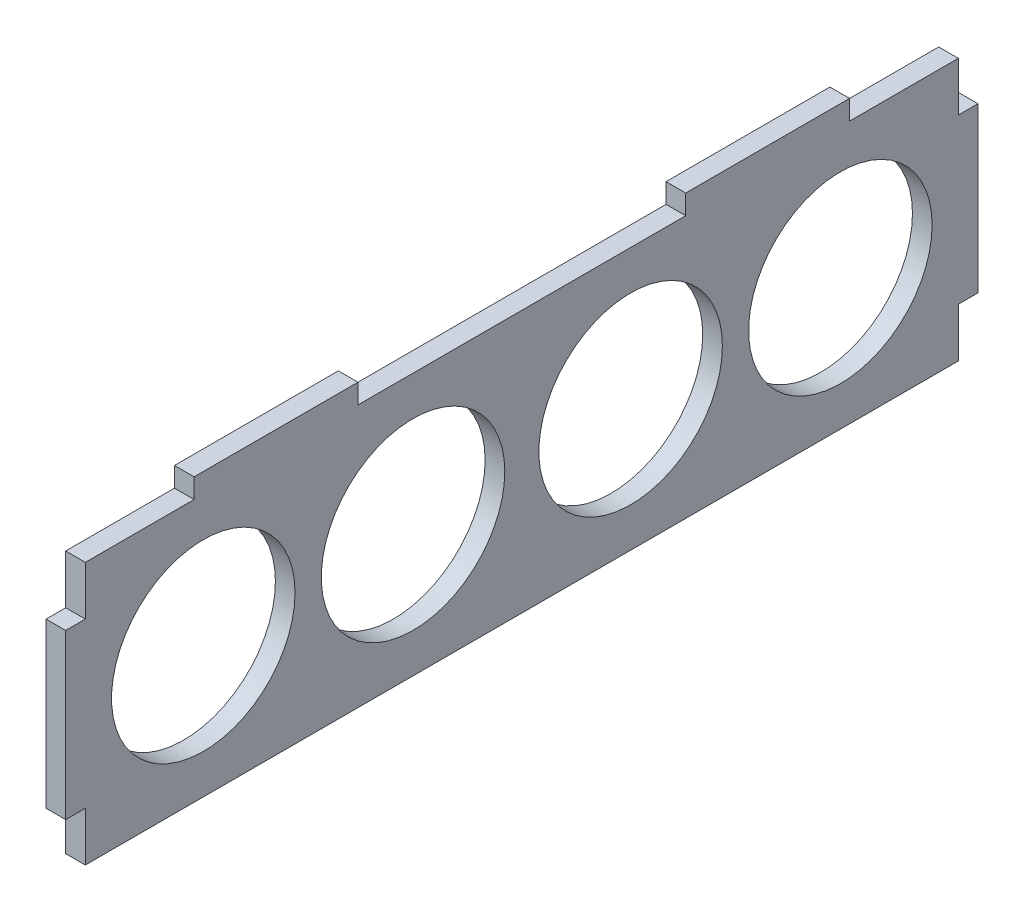
ISO-10303-21;
HEADER;
FILE_DESCRIPTION(('STEP AP214'),'2;1');
FILE_NAME('part.step','',(''),(''),'','','');
FILE_SCHEMA(('AUTOMOTIVE_DESIGN { 1 0 10303 214 1 1 1 1 }'));
ENDSEC;
DATA;
#1=APPLICATION_CONTEXT('core data for automotive mechanical design processes');
#2=APPLICATION_PROTOCOL_DEFINITION('international standard','automotive_design',2000,#1);
#3=PRODUCT_CONTEXT('',#1,'mechanical');
#4=PRODUCT('Part','Part','',(#3));
#5=PRODUCT_RELATED_PRODUCT_CATEGORY('part','',(#4));
#6=PRODUCT_DEFINITION_FORMATION('','',#4);
#7=PRODUCT_DEFINITION_CONTEXT('part definition',#1,'design');
#8=PRODUCT_DEFINITION('design','',#6,#7);
#9=PRODUCT_DEFINITION_SHAPE('','',#8);
#10=(LENGTH_UNIT() NAMED_UNIT(*) SI_UNIT(.MILLI.,.METRE.));
#11=(NAMED_UNIT(*) PLANE_ANGLE_UNIT() SI_UNIT($,.RADIAN.));
#12=(NAMED_UNIT(*) SI_UNIT($,.STERADIAN.) SOLID_ANGLE_UNIT());
#13=UNCERTAINTY_MEASURE_WITH_UNIT(LENGTH_MEASURE(1.E-05),#10,'distance_accuracy_value','');
#14=(GEOMETRIC_REPRESENTATION_CONTEXT(3) GLOBAL_UNCERTAINTY_ASSIGNED_CONTEXT((#13)) GLOBAL_UNIT_ASSIGNED_CONTEXT((#10,
#11,#12)) REPRESENTATION_CONTEXT('',''));
#15=CARTESIAN_POINT('',(0.,0.,0.));
#16=DIRECTION('',(0.,0.,1.));
#17=DIRECTION('',(1.,0.,0.));
#18=AXIS2_PLACEMENT_3D('',#15,#16,#17);
#19=CARTESIAN_POINT('',(3.,-20.,0.));
#20=DIRECTION('',(0.,1.,0.));
#21=DIRECTION('',(0.,0.,1.));
#22=AXIS2_PLACEMENT_3D('',#19,#20,#21);
#23=PLANE('',#22);
#24=DIRECTION('',(0.,0.,-1.));
#25=VECTOR('',#24,1.);
#26=CARTESIAN_POINT('',(0.,-20.,0.));
#27=LINE('',#26,#25);
#28=CARTESIAN_POINT('',(0.,-20.,66.6));
#29=VERTEX_POINT('',#28);
#30=CARTESIAN_POINT('',(0.,-20.,-66.6));
#31=VERTEX_POINT('',#30);
#32=EDGE_CURVE('E223',#29,#31,#27,.T.);
#33=ORIENTED_EDGE('',*,*,#32,.T.);
#34=DIRECTION('',(-1.,0.,0.));
#35=VECTOR('',#34,1.);
#36=CARTESIAN_POINT('',(3.,-20.,-66.6));
#37=LINE('',#36,#35);
#38=CARTESIAN_POINT('',(3.,-20.,-66.6));
#39=VERTEX_POINT('',#38);
#40=EDGE_CURVE('E11',#39,#31,#37,.T.);
#41=ORIENTED_EDGE('',*,*,#40,.F.);
#42=DIRECTION('',(0.,0.,-1.));
#43=VECTOR('',#42,1.);
#44=CARTESIAN_POINT('',(3.,-20.,0.));
#45=LINE('',#44,#43);
#46=CARTESIAN_POINT('',(3.,-20.,66.6));
#47=VERTEX_POINT('',#46);
#48=EDGE_CURVE('E675',#47,#39,#45,.T.);
#49=ORIENTED_EDGE('',*,*,#48,.F.);
#50=DIRECTION('',(-1.,0.,0.));
#51=VECTOR('',#50,1.);
#52=CARTESIAN_POINT('',(3.,-20.,66.6));
#53=LINE('',#52,#51);
#54=EDGE_CURVE('E56',#47,#29,#53,.T.);
#55=ORIENTED_EDGE('',*,*,#54,.T.);
#56=EDGE_LOOP('',(#33,#41,#49,#55));
#57=FACE_BOUND('',#56,.T.);
#58=ADVANCED_FACE('F39',(#57),#23,.F.);
#59=CARTESIAN_POINT('',(3.,0.,-66.6));
#60=DIRECTION('',(0.,0.,1.));
#61=DIRECTION('',(1.,0.,0.));
#62=AXIS2_PLACEMENT_3D('',#59,#60,#61);
#63=PLANE('',#62);
#64=DIRECTION('',(0.,1.,0.));
#65=VECTOR('',#64,1.);
#66=CARTESIAN_POINT('',(0.,0.,-66.6));
#67=LINE('',#66,#65);
#68=CARTESIAN_POINT('',(0.,-12.5,-66.6));
#69=VERTEX_POINT('',#68);
#70=EDGE_CURVE('E225',#31,#69,#67,.T.);
#71=ORIENTED_EDGE('',*,*,#70,.T.);
#72=DIRECTION('',(-1.,0.,0.));
#73=VECTOR('',#72,1.);
#74=CARTESIAN_POINT('',(3.,-12.5,-66.6));
#75=LINE('',#74,#73);
#76=CARTESIAN_POINT('',(3.,-12.5,-66.6));
#77=VERTEX_POINT('',#76);
#78=EDGE_CURVE('E48',#77,#69,#75,.T.);
#79=ORIENTED_EDGE('',*,*,#78,.F.);
#80=DIRECTION('',(0.,1.,0.));
#81=VECTOR('',#80,1.);
#82=CARTESIAN_POINT('',(3.,0.,-66.6));
#83=LINE('',#82,#81);
#84=EDGE_CURVE('E130',#39,#77,#83,.T.);
#85=ORIENTED_EDGE('',*,*,#84,.F.);
#86=ORIENTED_EDGE('',*,*,#40,.T.);
#87=EDGE_LOOP('',(#71,#79,#85,#86));
#88=FACE_BOUND('',#87,.T.);
#89=ADVANCED_FACE('F391',(#88),#63,.F.);
#90=CARTESIAN_POINT('',(3.,-12.5,0.));
#91=DIRECTION('',(0.,1.,0.));
#92=DIRECTION('',(0.,0.,1.));
#93=AXIS2_PLACEMENT_3D('',#90,#91,#92);
#94=PLANE('',#93);
#95=DIRECTION('',(0.,0.,-1.));
#96=VECTOR('',#95,1.);
#97=CARTESIAN_POINT('',(0.,-12.5,0.));
#98=LINE('',#97,#96);
#99=CARTESIAN_POINT('',(0.,-12.5,-69.6));
#100=VERTEX_POINT('',#99);
#101=EDGE_CURVE('E227',#69,#100,#98,.T.);
#102=ORIENTED_EDGE('',*,*,#101,.T.);
#103=DIRECTION('',(-1.,0.,0.));
#104=VECTOR('',#103,1.);
#105=CARTESIAN_POINT('',(3.,-12.5,-69.6));
#106=LINE('',#105,#104);
#107=CARTESIAN_POINT('',(3.,-12.5,-69.6));
#108=VERTEX_POINT('',#107);
#109=EDGE_CURVE('E298',#108,#100,#106,.T.);
#110=ORIENTED_EDGE('',*,*,#109,.F.);
#111=DIRECTION('',(0.,0.,-1.));
#112=VECTOR('',#111,1.);
#113=CARTESIAN_POINT('',(3.,-12.5,0.));
#114=LINE('',#113,#112);
#115=EDGE_CURVE('E305',#77,#108,#114,.T.);
#116=ORIENTED_EDGE('',*,*,#115,.F.);
#117=ORIENTED_EDGE('',*,*,#78,.T.);
#118=EDGE_LOOP('',(#102,#110,#116,#117));
#119=FACE_BOUND('',#118,.T.);
#120=ADVANCED_FACE('F303',(#119),#94,.F.);
#121=CARTESIAN_POINT('',(3.,0.,-69.6));
#122=DIRECTION('',(0.,0.,-1.));
#123=DIRECTION('',(-1.,0.,0.));
#124=AXIS2_PLACEMENT_3D('',#121,#122,#123);
#125=PLANE('',#124);
#126=DIRECTION('',(0.,-1.,0.));
#127=VECTOR('',#126,1.);
#128=CARTESIAN_POINT('',(0.,0.,-69.6));
#129=LINE('',#128,#127);
#130=CARTESIAN_POINT('',(0.,12.5,-69.6));
#131=VERTEX_POINT('',#130);
#132=EDGE_CURVE('E231',#131,#100,#129,.T.);
#133=ORIENTED_EDGE('',*,*,#132,.F.);
#134=DIRECTION('',(-1.,0.,0.));
#135=VECTOR('',#134,1.);
#136=CARTESIAN_POINT('',(3.,12.5,-69.6));
#137=LINE('',#136,#135);
#138=CARTESIAN_POINT('',(3.,12.5,-69.6));
#139=VERTEX_POINT('',#138);
#140=EDGE_CURVE('E296',#139,#131,#137,.T.);
#141=ORIENTED_EDGE('',*,*,#140,.F.);
#142=DIRECTION('',(0.,-1.,0.));
#143=VECTOR('',#142,1.);
#144=CARTESIAN_POINT('',(3.,0.,-69.6));
#145=LINE('',#144,#143);
#146=EDGE_CURVE('E315',#139,#108,#145,.T.);
#147=ORIENTED_EDGE('',*,*,#146,.T.);
#148=ORIENTED_EDGE('',*,*,#109,.T.);
#149=EDGE_LOOP('',(#133,#141,#147,#148));
#150=FACE_BOUND('',#149,.T.);
#151=ADVANCED_FACE('F312',(#150),#125,.T.);
#152=CARTESIAN_POINT('',(3.,12.5,0.));
#153=DIRECTION('',(0.,1.,0.));
#154=DIRECTION('',(0.,0.,1.));
#155=AXIS2_PLACEMENT_3D('',#152,#153,#154);
#156=PLANE('',#155);
#157=DIRECTION('',(0.,0.,-1.));
#158=VECTOR('',#157,1.);
#159=CARTESIAN_POINT('',(0.,12.5,0.));
#160=LINE('',#159,#158);
#161=CARTESIAN_POINT('',(0.,12.5,-66.6));
#162=VERTEX_POINT('',#161);
#163=EDGE_CURVE('E234',#162,#131,#160,.T.);
#164=ORIENTED_EDGE('',*,*,#163,.F.);
#165=DIRECTION('',(-1.,0.,0.));
#166=VECTOR('',#165,1.);
#167=CARTESIAN_POINT('',(3.,12.5,-66.6));
#168=LINE('',#167,#166);
#169=CARTESIAN_POINT('',(3.,12.5,-66.6));
#170=VERTEX_POINT('',#169);
#171=EDGE_CURVE('E294',#170,#162,#168,.T.);
#172=ORIENTED_EDGE('',*,*,#171,.F.);
#173=DIRECTION('',(0.,0.,-1.));
#174=VECTOR('',#173,1.);
#175=CARTESIAN_POINT('',(3.,12.5,0.));
#176=LINE('',#175,#174);
#177=EDGE_CURVE('E318',#170,#139,#176,.T.);
#178=ORIENTED_EDGE('',*,*,#177,.T.);
#179=ORIENTED_EDGE('',*,*,#140,.T.);
#180=EDGE_LOOP('',(#164,#172,#178,#179));
#181=FACE_BOUND('',#180,.T.);
#182=ADVANCED_FACE('F622',(#181),#156,.T.);
#183=CARTESIAN_POINT('',(0.,20.,-66.6));
#184=VERTEX_POINT('',#183);
#185=EDGE_CURVE('E228',#162,#184,#67,.T.);
#186=ORIENTED_EDGE('',*,*,#185,.T.);
#187=DIRECTION('',(-1.,0.,0.));
#188=VECTOR('',#187,1.);
#189=CARTESIAN_POINT('',(3.,20.,-66.6));
#190=LINE('',#189,#188);
#191=CARTESIAN_POINT('',(3.,20.,-66.6));
#192=VERTEX_POINT('',#191);
#193=EDGE_CURVE('E292',#192,#184,#190,.T.);
#194=ORIENTED_EDGE('',*,*,#193,.F.);
#195=EDGE_CURVE('E320',#170,#192,#83,.T.);
#196=ORIENTED_EDGE('',*,*,#195,.F.);
#197=ORIENTED_EDGE('',*,*,#171,.T.);
#198=EDGE_LOOP('',(#186,#194,#196,#197));
#199=FACE_BOUND('',#198,.T.);
#200=ADVANCED_FACE('F397',(#199),#63,.F.);
#201=CARTESIAN_POINT('',(3.,20.,0.));
#202=DIRECTION('',(0.,1.,0.));
#203=DIRECTION('',(0.,0.,1.));
#204=AXIS2_PLACEMENT_3D('',#201,#202,#203);
#205=PLANE('',#204);
#206=DIRECTION('',(0.,0.,-1.));
#207=VECTOR('',#206,1.);
#208=CARTESIAN_POINT('',(0.,20.,0.));
#209=LINE('',#208,#207);
#210=CARTESIAN_POINT('',(0.,20.,-50.));
#211=VERTEX_POINT('',#210);
#212=EDGE_CURVE('E237',#211,#184,#209,.T.);
#213=ORIENTED_EDGE('',*,*,#212,.F.);
#214=DIRECTION('',(-1.,0.,0.));
#215=VECTOR('',#214,1.);
#216=CARTESIAN_POINT('',(3.,20.,-50.));
#217=LINE('',#216,#215);
#218=CARTESIAN_POINT('',(3.,20.,-50.));
#219=VERTEX_POINT('',#218);
#220=EDGE_CURVE('E290',#219,#211,#217,.T.);
#221=ORIENTED_EDGE('',*,*,#220,.F.);
#222=DIRECTION('',(0.,0.,-1.));
#223=VECTOR('',#222,1.);
#224=CARTESIAN_POINT('',(3.,20.,0.));
#225=LINE('',#224,#223);
#226=EDGE_CURVE('E325',#219,#192,#225,.T.);
#227=ORIENTED_EDGE('',*,*,#226,.T.);
#228=ORIENTED_EDGE('',*,*,#193,.T.);
#229=EDGE_LOOP('',(#213,#221,#227,#228));
#230=FACE_BOUND('',#229,.T.);
#231=ADVANCED_FACE('F388',(#230),#205,.T.);
#232=CARTESIAN_POINT('',(3.,0.,-50.));
#233=DIRECTION('',(0.,0.,1.));
#234=DIRECTION('',(1.,0.,0.));
#235=AXIS2_PLACEMENT_3D('',#232,#233,#234);
#236=PLANE('',#235);
#237=DIRECTION('',(0.,1.,0.));
#238=VECTOR('',#237,1.);
#239=CARTESIAN_POINT('',(0.,0.,-50.));
#240=LINE('',#239,#238);
#241=CARTESIAN_POINT('',(0.,23.,-50.));
#242=VERTEX_POINT('',#241);
#243=EDGE_CURVE('E240',#211,#242,#240,.T.);
#244=ORIENTED_EDGE('',*,*,#243,.T.);
#245=DIRECTION('',(-1.,0.,0.));
#246=VECTOR('',#245,1.);
#247=CARTESIAN_POINT('',(3.,23.,-50.));
#248=LINE('',#247,#246);
#249=CARTESIAN_POINT('',(3.,23.,-50.));
#250=VERTEX_POINT('',#249);
#251=EDGE_CURVE('E288',#250,#242,#248,.T.);
#252=ORIENTED_EDGE('',*,*,#251,.F.);
#253=DIRECTION('',(0.,1.,0.));
#254=VECTOR('',#253,1.);
#255=CARTESIAN_POINT('',(3.,0.,-50.));
#256=LINE('',#255,#254);
#257=EDGE_CURVE('E328',#219,#250,#256,.T.);
#258=ORIENTED_EDGE('',*,*,#257,.F.);
#259=ORIENTED_EDGE('',*,*,#220,.T.);
#260=EDGE_LOOP('',(#244,#252,#258,#259));
#261=FACE_BOUND('',#260,.T.);
#262=ADVANCED_FACE('F594',(#261),#236,.F.);
#263=CARTESIAN_POINT('',(3.,23.,0.));
#264=DIRECTION('',(0.,1.,0.));
#265=DIRECTION('',(0.,0.,1.));
#266=AXIS2_PLACEMENT_3D('',#263,#264,#265);
#267=PLANE('',#266);
#268=DIRECTION('',(0.,0.,-1.));
#269=VECTOR('',#268,1.);
#270=CARTESIAN_POINT('',(0.,23.,0.));
#271=LINE('',#270,#269);
#272=CARTESIAN_POINT('',(0.,23.,-25.));
#273=VERTEX_POINT('',#272);
#274=EDGE_CURVE('E245',#273,#242,#271,.T.);
#275=ORIENTED_EDGE('',*,*,#274,.F.);
#276=DIRECTION('',(-1.,0.,0.));
#277=VECTOR('',#276,1.);
#278=CARTESIAN_POINT('',(3.,23.,-25.));
#279=LINE('',#278,#277);
#280=CARTESIAN_POINT('',(3.,23.,-25.));
#281=VERTEX_POINT('',#280);
#282=EDGE_CURVE('E286',#281,#273,#279,.T.);
#283=ORIENTED_EDGE('',*,*,#282,.F.);
#284=DIRECTION('',(0.,0.,-1.));
#285=VECTOR('',#284,1.);
#286=CARTESIAN_POINT('',(3.,23.,0.));
#287=LINE('',#286,#285);
#288=EDGE_CURVE('E332',#281,#250,#287,.T.);
#289=ORIENTED_EDGE('',*,*,#288,.T.);
#290=ORIENTED_EDGE('',*,*,#251,.T.);
#291=EDGE_LOOP('',(#275,#283,#289,#290));
#292=FACE_BOUND('',#291,.T.);
#293=ADVANCED_FACE('F586',(#292),#267,.T.);
#294=CARTESIAN_POINT('',(3.,0.,-25.));
#295=DIRECTION('',(0.,0.,1.));
#296=DIRECTION('',(1.,0.,0.));
#297=AXIS2_PLACEMENT_3D('',#294,#295,#296);
#298=PLANE('',#297);
#299=DIRECTION('',(0.,1.,0.));
#300=VECTOR('',#299,1.);
#301=CARTESIAN_POINT('',(0.,0.,-25.));
#302=LINE('',#301,#300);
#303=CARTESIAN_POINT('',(0.,20.,-25.));
#304=VERTEX_POINT('',#303);
#305=EDGE_CURVE('E248',#304,#273,#302,.T.);
#306=ORIENTED_EDGE('',*,*,#305,.F.);
#307=DIRECTION('',(-1.,0.,0.));
#308=VECTOR('',#307,1.);
#309=CARTESIAN_POINT('',(3.,20.,-25.));
#310=LINE('',#309,#308);
#311=CARTESIAN_POINT('',(3.,20.,-25.));
#312=VERTEX_POINT('',#311);
#313=EDGE_CURVE('E284',#312,#304,#310,.T.);
#314=ORIENTED_EDGE('',*,*,#313,.F.);
#315=DIRECTION('',(0.,1.,0.));
#316=VECTOR('',#315,1.);
#317=CARTESIAN_POINT('',(3.,0.,-25.));
#318=LINE('',#317,#316);
#319=EDGE_CURVE('E335',#312,#281,#318,.T.);
#320=ORIENTED_EDGE('',*,*,#319,.T.);
#321=ORIENTED_EDGE('',*,*,#282,.T.);
#322=EDGE_LOOP('',(#306,#314,#320,#321));
#323=FACE_BOUND('',#322,.T.);
#324=ADVANCED_FACE('F362',(#323),#298,.T.);
#325=CARTESIAN_POINT('',(0.,20.,25.));
#326=VERTEX_POINT('',#325);
#327=EDGE_CURVE('E242',#326,#304,#209,.T.);
#328=ORIENTED_EDGE('',*,*,#327,.F.);
#329=DIRECTION('',(-1.,0.,0.));
#330=VECTOR('',#329,1.);
#331=CARTESIAN_POINT('',(3.,20.,25.));
#332=LINE('',#331,#330);
#333=CARTESIAN_POINT('',(3.,20.,25.));
#334=VERTEX_POINT('',#333);
#335=EDGE_CURVE('E282',#334,#326,#332,.T.);
#336=ORIENTED_EDGE('',*,*,#335,.F.);
#337=EDGE_CURVE('E330',#334,#312,#225,.T.);
#338=ORIENTED_EDGE('',*,*,#337,.T.);
#339=ORIENTED_EDGE('',*,*,#313,.T.);
#340=EDGE_LOOP('',(#328,#336,#338,#339));
#341=FACE_BOUND('',#340,.T.);
#342=ADVANCED_FACE('F354',(#341),#205,.T.);
#343=CARTESIAN_POINT('',(3.,0.,25.));
#344=DIRECTION('',(0.,0.,1.));
#345=DIRECTION('',(1.,0.,0.));
#346=AXIS2_PLACEMENT_3D('',#343,#344,#345);
#347=PLANE('',#346);
#348=DIRECTION('',(0.,1.,0.));
#349=VECTOR('',#348,1.);
#350=CARTESIAN_POINT('',(0.,0.,25.));
#351=LINE('',#350,#349);
#352=CARTESIAN_POINT('',(0.,23.,25.));
#353=VERTEX_POINT('',#352);
#354=EDGE_CURVE('E251',#326,#353,#351,.T.);
#355=ORIENTED_EDGE('',*,*,#354,.T.);
#356=DIRECTION('',(-1.,0.,0.));
#357=VECTOR('',#356,1.);
#358=CARTESIAN_POINT('',(3.,23.,25.));
#359=LINE('',#358,#357);
#360=CARTESIAN_POINT('',(3.,23.,25.));
#361=VERTEX_POINT('',#360);
#362=EDGE_CURVE('E280',#361,#353,#359,.T.);
#363=ORIENTED_EDGE('',*,*,#362,.F.);
#364=DIRECTION('',(0.,1.,0.));
#365=VECTOR('',#364,1.);
#366=CARTESIAN_POINT('',(3.,0.,25.));
#367=LINE('',#366,#365);
#368=EDGE_CURVE('E338',#334,#361,#367,.T.);
#369=ORIENTED_EDGE('',*,*,#368,.F.);
#370=ORIENTED_EDGE('',*,*,#335,.T.);
#371=EDGE_LOOP('',(#355,#363,#369,#370));
#372=FACE_BOUND('',#371,.T.);
#373=ADVANCED_FACE('F379',(#372),#347,.F.);
#374=CARTESIAN_POINT('',(3.,23.,0.));
#375=DIRECTION('',(0.,1.,0.));
#376=DIRECTION('',(0.,0.,1.));
#377=AXIS2_PLACEMENT_3D('',#374,#375,#376);
#378=PLANE('',#377);
#379=DIRECTION('',(0.,0.,-1.));
#380=VECTOR('',#379,1.);
#381=CARTESIAN_POINT('',(0.,23.,0.));
#382=LINE('',#381,#380);
#383=CARTESIAN_POINT('',(0.,23.,50.));
#384=VERTEX_POINT('',#383);
#385=EDGE_CURVE('E254',#384,#353,#382,.T.);
#386=ORIENTED_EDGE('',*,*,#385,.F.);
#387=DIRECTION('',(-1.,0.,0.));
#388=VECTOR('',#387,1.);
#389=CARTESIAN_POINT('',(3.,23.,50.));
#390=LINE('',#389,#388);
#391=CARTESIAN_POINT('',(3.,23.,50.));
#392=VERTEX_POINT('',#391);
#393=EDGE_CURVE('E278',#392,#384,#390,.T.);
#394=ORIENTED_EDGE('',*,*,#393,.F.);
#395=DIRECTION('',(0.,0.,-1.));
#396=VECTOR('',#395,1.);
#397=CARTESIAN_POINT('',(3.,23.,0.));
#398=LINE('',#397,#396);
#399=EDGE_CURVE('E340',#392,#361,#398,.T.);
#400=ORIENTED_EDGE('',*,*,#399,.T.);
#401=ORIENTED_EDGE('',*,*,#362,.T.);
#402=EDGE_LOOP('',(#386,#394,#400,#401));
#403=FACE_BOUND('',#402,.T.);
#404=ADVANCED_FACE('F377',(#403),#378,.T.);
#405=CARTESIAN_POINT('',(3.,0.,50.));
#406=DIRECTION('',(0.,0.,1.));
#407=DIRECTION('',(1.,0.,0.));
#408=AXIS2_PLACEMENT_3D('',#405,#406,#407);
#409=PLANE('',#408);
#410=DIRECTION('',(0.,1.,0.));
#411=VECTOR('',#410,1.);
#412=CARTESIAN_POINT('',(0.,0.,50.));
#413=LINE('',#412,#411);
#414=CARTESIAN_POINT('',(0.,20.,50.));
#415=VERTEX_POINT('',#414);
#416=EDGE_CURVE('E257',#415,#384,#413,.T.);
#417=ORIENTED_EDGE('',*,*,#416,.F.);
#418=DIRECTION('',(-1.,0.,0.));
#419=VECTOR('',#418,1.);
#420=CARTESIAN_POINT('',(3.,20.,50.));
#421=LINE('',#420,#419);
#422=CARTESIAN_POINT('',(3.,20.,50.));
#423=VERTEX_POINT('',#422);
#424=EDGE_CURVE('E276',#423,#415,#421,.T.);
#425=ORIENTED_EDGE('',*,*,#424,.F.);
#426=DIRECTION('',(0.,1.,0.));
#427=VECTOR('',#426,1.);
#428=CARTESIAN_POINT('',(3.,0.,50.));
#429=LINE('',#428,#427);
#430=EDGE_CURVE('E343',#423,#392,#429,.T.);
#431=ORIENTED_EDGE('',*,*,#430,.T.);
#432=ORIENTED_EDGE('',*,*,#393,.T.);
#433=EDGE_LOOP('',(#417,#425,#431,#432));
#434=FACE_BOUND('',#433,.T.);
#435=ADVANCED_FACE('F374',(#434),#409,.T.);
#436=CARTESIAN_POINT('',(0.,20.,66.6));
#437=VERTEX_POINT('',#436);
#438=EDGE_CURVE('E241',#437,#415,#209,.T.);
#439=ORIENTED_EDGE('',*,*,#438,.F.);
#440=DIRECTION('',(-1.,0.,0.));
#441=VECTOR('',#440,1.);
#442=CARTESIAN_POINT('',(3.,20.,66.6));
#443=LINE('',#442,#441);
#444=CARTESIAN_POINT('',(3.,20.,66.6));
#445=VERTEX_POINT('',#444);
#446=EDGE_CURVE('E274',#445,#437,#443,.T.);
#447=ORIENTED_EDGE('',*,*,#446,.F.);
#448=EDGE_CURVE('E329',#445,#423,#225,.T.);
#449=ORIENTED_EDGE('',*,*,#448,.T.);
#450=ORIENTED_EDGE('',*,*,#424,.T.);
#451=EDGE_LOOP('',(#439,#447,#449,#450));
#452=FACE_BOUND('',#451,.T.);
#453=ADVANCED_FACE('F371',(#452),#205,.T.);
#454=CARTESIAN_POINT('',(3.,0.,66.6));
#455=DIRECTION('',(0.,0.,1.));
#456=DIRECTION('',(1.,0.,0.));
#457=AXIS2_PLACEMENT_3D('',#454,#455,#456);
#458=PLANE('',#457);
#459=DIRECTION('',(0.,1.,0.));
#460=VECTOR('',#459,1.);
#461=CARTESIAN_POINT('',(0.,0.,66.6));
#462=LINE('',#461,#460);
#463=CARTESIAN_POINT('',(0.,12.5,66.6));
#464=VERTEX_POINT('',#463);
#465=EDGE_CURVE('E260',#464,#437,#462,.T.);
#466=ORIENTED_EDGE('',*,*,#465,.F.);
#467=DIRECTION('',(-1.,0.,0.));
#468=VECTOR('',#467,1.);
#469=CARTESIAN_POINT('',(3.,12.5,66.6));
#470=LINE('',#469,#468);
#471=CARTESIAN_POINT('',(3.,12.5,66.6));
#472=VERTEX_POINT('',#471);
#473=EDGE_CURVE('E272',#472,#464,#470,.T.);
#474=ORIENTED_EDGE('',*,*,#473,.F.);
#475=DIRECTION('',(0.,1.,0.));
#476=VECTOR('',#475,1.);
#477=CARTESIAN_POINT('',(3.,0.,66.6));
#478=LINE('',#477,#476);
#479=EDGE_CURVE('E208',#472,#445,#478,.T.);
#480=ORIENTED_EDGE('',*,*,#479,.T.);
#481=ORIENTED_EDGE('',*,*,#446,.T.);
#482=EDGE_LOOP('',(#466,#474,#480,#481));
#483=FACE_BOUND('',#482,.T.);
#484=ADVANCED_FACE('F439',(#483),#458,.T.);
#485=CARTESIAN_POINT('',(3.,12.5,0.));
#486=DIRECTION('',(0.,-1.,0.));
#487=DIRECTION('',(0.,0.,-1.));
#488=AXIS2_PLACEMENT_3D('',#485,#486,#487);
#489=PLANE('',#488);
#490=DIRECTION('',(0.,0.,1.));
#491=VECTOR('',#490,1.);
#492=CARTESIAN_POINT('',(0.,12.5,0.));
#493=LINE('',#492,#491);
#494=CARTESIAN_POINT('',(0.,12.5,69.6));
#495=VERTEX_POINT('',#494);
#496=EDGE_CURVE('E263',#464,#495,#493,.T.);
#497=ORIENTED_EDGE('',*,*,#496,.T.);
#498=DIRECTION('',(-1.,0.,0.));
#499=VECTOR('',#498,1.);
#500=CARTESIAN_POINT('',(3.,12.5,69.6));
#501=LINE('',#500,#499);
#502=CARTESIAN_POINT('',(3.,12.5,69.6));
#503=VERTEX_POINT('',#502);
#504=EDGE_CURVE('E202',#503,#495,#501,.T.);
#505=ORIENTED_EDGE('',*,*,#504,.F.);
#506=DIRECTION('',(0.,0.,1.));
#507=VECTOR('',#506,1.);
#508=CARTESIAN_POINT('',(3.,12.5,0.));
#509=LINE('',#508,#507);
#510=EDGE_CURVE('E190',#472,#503,#509,.T.);
#511=ORIENTED_EDGE('',*,*,#510,.F.);
#512=ORIENTED_EDGE('',*,*,#473,.T.);
#513=EDGE_LOOP('',(#497,#505,#511,#512));
#514=FACE_BOUND('',#513,.T.);
#515=ADVANCED_FACE('F444',(#514),#489,.F.);
#516=CARTESIAN_POINT('',(3.,0.,69.6));
#517=DIRECTION('',(0.,0.,-1.));
#518=DIRECTION('',(-1.,0.,0.));
#519=AXIS2_PLACEMENT_3D('',#516,#517,#518);
#520=PLANE('',#519);
#521=DIRECTION('',(0.,-1.,0.));
#522=VECTOR('',#521,1.);
#523=CARTESIAN_POINT('',(0.,0.,69.6));
#524=LINE('',#523,#522);
#525=CARTESIAN_POINT('',(0.,-12.5,69.6));
#526=VERTEX_POINT('',#525);
#527=EDGE_CURVE('E199',#495,#526,#524,.T.);
#528=ORIENTED_EDGE('',*,*,#527,.T.);
#529=DIRECTION('',(-1.,0.,0.));
#530=VECTOR('',#529,1.);
#531=CARTESIAN_POINT('',(3.,-12.5,69.6));
#532=LINE('',#531,#530);
#533=CARTESIAN_POINT('',(3.,-12.5,69.6));
#534=VERTEX_POINT('',#533);
#535=EDGE_CURVE('E196',#534,#526,#532,.T.);
#536=ORIENTED_EDGE('',*,*,#535,.F.);
#537=DIRECTION('',(0.,-1.,0.));
#538=VECTOR('',#537,1.);
#539=CARTESIAN_POINT('',(3.,0.,69.6));
#540=LINE('',#539,#538);
#541=EDGE_CURVE('E182',#503,#534,#540,.T.);
#542=ORIENTED_EDGE('',*,*,#541,.F.);
#543=ORIENTED_EDGE('',*,*,#504,.T.);
#544=EDGE_LOOP('',(#528,#536,#542,#543));
#545=FACE_BOUND('',#544,.T.);
#546=ADVANCED_FACE('F197',(#545),#520,.F.);
#547=CARTESIAN_POINT('',(3.,-12.5,0.));
#548=DIRECTION('',(0.,-1.,0.));
#549=DIRECTION('',(0.,0.,-1.));
#550=AXIS2_PLACEMENT_3D('',#547,#548,#549);
#551=PLANE('',#550);
#552=DIRECTION('',(0.,0.,1.));
#553=VECTOR('',#552,1.);
#554=CARTESIAN_POINT('',(0.,-12.5,0.));
#555=LINE('',#554,#553);
#556=CARTESIAN_POINT('',(0.,-12.5,66.6));
#557=VERTEX_POINT('',#556);
#558=EDGE_CURVE('E267',#557,#526,#555,.T.);
#559=ORIENTED_EDGE('',*,*,#558,.F.);
#560=DIRECTION('',(-1.,0.,0.));
#561=VECTOR('',#560,1.);
#562=CARTESIAN_POINT('',(3.,-12.5,66.6));
#563=LINE('',#562,#561);
#564=CARTESIAN_POINT('',(3.,-12.5,66.6));
#565=VERTEX_POINT('',#564);
#566=EDGE_CURVE('E118',#565,#557,#563,.T.);
#567=ORIENTED_EDGE('',*,*,#566,.F.);
#568=DIRECTION('',(0.,0.,1.));
#569=VECTOR('',#568,1.);
#570=CARTESIAN_POINT('',(3.,-12.5,0.));
#571=LINE('',#570,#569);
#572=EDGE_CURVE('E187',#565,#534,#571,.T.);
#573=ORIENTED_EDGE('',*,*,#572,.T.);
#574=ORIENTED_EDGE('',*,*,#535,.T.);
#575=EDGE_LOOP('',(#559,#567,#573,#574));
#576=FACE_BOUND('',#575,.T.);
#577=ADVANCED_FACE('F204',(#576),#551,.T.);
#578=CARTESIAN_POINT('',(3.,0.,48.6));
#579=DIRECTION('',(-1.,0.,0.));
#580=DIRECTION('',(0.,0.,1.));
#581=AXIS2_PLACEMENT_3D('',#578,#579,#580);
#582=CYLINDRICAL_SURFACE('',#581,14.);
#583=CARTESIAN_POINT('',(3.,0.,48.6));
#584=DIRECTION('',(1.,0.,0.));
#585=DIRECTION('',(0.,0.,-1.));
#586=AXIS2_PLACEMENT_3D('',#583,#584,#585);
#587=CIRCLE('',#586,14.);
#588=CARTESIAN_POINT('',(3.,0.,34.6));
#589=VERTEX_POINT('',#588);
#590=EDGE_CURVE('E676',#589,#589,#587,.T.);
#591=ORIENTED_EDGE('',*,*,#590,.T.);
#592=EDGE_LOOP('',(#591));
#593=FACE_BOUND('',#592,.T.);
#594=CARTESIAN_POINT('',(0.,0.,48.6));
#595=DIRECTION('',(1.,0.,0.));
#596=DIRECTION('',(0.,0.,-1.));
#597=AXIS2_PLACEMENT_3D('',#594,#595,#596);
#598=CIRCLE('',#597,14.);
#599=CARTESIAN_POINT('',(0.,0.,34.6));
#600=VERTEX_POINT('',#599);
#601=EDGE_CURVE('E220',#600,#600,#598,.T.);
#602=ORIENTED_EDGE('',*,*,#601,.F.);
#603=EDGE_LOOP('',(#602));
#604=FACE_BOUND('',#603,.T.);
#605=ADVANCED_FACE('F401',(#593,#604),#582,.F.);
#606=CARTESIAN_POINT('',(3.,0.,-48.6));
#607=DIRECTION('',(-1.,0.,0.));
#608=DIRECTION('',(0.,0.,1.));
#609=AXIS2_PLACEMENT_3D('',#606,#607,#608);
#610=CYLINDRICAL_SURFACE('',#609,14.);
#611=CARTESIAN_POINT('',(3.,0.,-48.6));
#612=DIRECTION('',(1.,0.,0.));
#613=DIRECTION('',(0.,0.,-1.));
#614=AXIS2_PLACEMENT_3D('',#611,#612,#613);
#615=CIRCLE('',#614,14.);
#616=CARTESIAN_POINT('',(3.,0.,-62.6));
#617=VERTEX_POINT('',#616);
#618=EDGE_CURVE('E679',#617,#617,#615,.T.);
#619=ORIENTED_EDGE('',*,*,#618,.T.);
#620=EDGE_LOOP('',(#619));
#621=FACE_BOUND('',#620,.T.);
#622=CARTESIAN_POINT('',(0.,0.,-48.6));
#623=DIRECTION('',(1.,0.,0.));
#624=DIRECTION('',(0.,0.,-1.));
#625=AXIS2_PLACEMENT_3D('',#622,#623,#624);
#626=CIRCLE('',#625,14.);
#627=CARTESIAN_POINT('',(0.,0.,-62.6));
#628=VERTEX_POINT('',#627);
#629=EDGE_CURVE('E217',#628,#628,#626,.T.);
#630=ORIENTED_EDGE('',*,*,#629,.F.);
#631=EDGE_LOOP('',(#630));
#632=FACE_BOUND('',#631,.T.);
#633=ADVANCED_FACE('F404',(#621,#632),#610,.F.);
#634=CARTESIAN_POINT('',(3.,0.,16.6));
#635=DIRECTION('',(-1.,0.,0.));
#636=DIRECTION('',(0.,0.,1.));
#637=AXIS2_PLACEMENT_3D('',#634,#635,#636);
#638=CYLINDRICAL_SURFACE('',#637,14.);
#639=CARTESIAN_POINT('',(3.,0.,16.6));
#640=DIRECTION('',(1.,0.,0.));
#641=DIRECTION('',(0.,0.,-1.));
#642=AXIS2_PLACEMENT_3D('',#639,#640,#641);
#643=CIRCLE('',#642,14.);
#644=CARTESIAN_POINT('',(3.,0.,2.6));
#645=VERTEX_POINT('',#644);
#646=EDGE_CURVE('E419',#645,#645,#643,.T.);
#647=ORIENTED_EDGE('',*,*,#646,.T.);
#648=EDGE_LOOP('',(#647));
#649=FACE_BOUND('',#648,.T.);
#650=CARTESIAN_POINT('',(0.,0.,16.6));
#651=DIRECTION('',(1.,0.,0.));
#652=DIRECTION('',(0.,0.,-1.));
#653=AXIS2_PLACEMENT_3D('',#650,#651,#652);
#654=CIRCLE('',#653,14.);
#655=CARTESIAN_POINT('',(0.,0.,2.6));
#656=VERTEX_POINT('',#655);
#657=EDGE_CURVE('E214',#656,#656,#654,.T.);
#658=ORIENTED_EDGE('',*,*,#657,.F.);
#659=EDGE_LOOP('',(#658));
#660=FACE_BOUND('',#659,.T.);
#661=ADVANCED_FACE('F407',(#649,#660),#638,.F.);
#662=CARTESIAN_POINT('',(3.,0.,-16.6));
#663=DIRECTION('',(-1.,0.,0.));
#664=DIRECTION('',(0.,0.,1.));
#665=AXIS2_PLACEMENT_3D('',#662,#663,#664);
#666=CYLINDRICAL_SURFACE('',#665,14.);
#667=CARTESIAN_POINT('',(3.,0.,-16.6));
#668=DIRECTION('',(1.,0.,0.));
#669=DIRECTION('',(0.,0.,-1.));
#670=AXIS2_PLACEMENT_3D('',#667,#668,#669);
#671=CIRCLE('',#670,14.);
#672=CARTESIAN_POINT('',(3.,0.,-30.6));
#673=VERTEX_POINT('',#672);
#674=EDGE_CURVE('E685',#673,#673,#671,.T.);
#675=ORIENTED_EDGE('',*,*,#674,.T.);
#676=EDGE_LOOP('',(#675));
#677=FACE_BOUND('',#676,.T.);
#678=CARTESIAN_POINT('',(0.,0.,-16.6));
#679=DIRECTION('',(1.,0.,0.));
#680=DIRECTION('',(0.,0.,-1.));
#681=AXIS2_PLACEMENT_3D('',#678,#679,#680);
#682=CIRCLE('',#681,14.);
#683=CARTESIAN_POINT('',(0.,0.,-30.6));
#684=VERTEX_POINT('',#683);
#685=EDGE_CURVE('E211',#684,#684,#682,.T.);
#686=ORIENTED_EDGE('',*,*,#685,.F.);
#687=EDGE_LOOP('',(#686));
#688=FACE_BOUND('',#687,.T.);
#689=ADVANCED_FACE('F41',(#677,#688),#666,.F.);
#690=EDGE_CURVE('E264',#29,#557,#462,.T.);
#691=ORIENTED_EDGE('',*,*,#690,.F.);
#692=ORIENTED_EDGE('',*,*,#54,.F.);
#693=EDGE_CURVE('E205',#47,#565,#478,.T.);
#694=ORIENTED_EDGE('',*,*,#693,.T.);
#695=ORIENTED_EDGE('',*,*,#566,.T.);
#696=EDGE_LOOP('',(#691,#692,#694,#695));
#697=FACE_BOUND('',#696,.T.);
#698=ADVANCED_FACE('F414',(#697),#458,.T.);
#699=CARTESIAN_POINT('',(3.,0.,0.));
#700=DIRECTION('',(1.,0.,0.));
#701=DIRECTION('',(0.,0.,-1.));
#702=AXIS2_PLACEMENT_3D('',#699,#700,#701);
#703=PLANE('',#702);
#704=ORIENTED_EDGE('',*,*,#674,.F.);
#705=EDGE_LOOP('',(#704));
#706=FACE_BOUND('',#705,.T.);
#707=ORIENTED_EDGE('',*,*,#646,.F.);
#708=EDGE_LOOP('',(#707));
#709=FACE_BOUND('',#708,.T.);
#710=ORIENTED_EDGE('',*,*,#618,.F.);
#711=EDGE_LOOP('',(#710));
#712=FACE_BOUND('',#711,.T.);
#713=ORIENTED_EDGE('',*,*,#590,.F.);
#714=EDGE_LOOP('',(#713));
#715=FACE_BOUND('',#714,.T.);
#716=ORIENTED_EDGE('',*,*,#48,.T.);
#717=ORIENTED_EDGE('',*,*,#84,.T.);
#718=ORIENTED_EDGE('',*,*,#115,.T.);
#719=ORIENTED_EDGE('',*,*,#146,.F.);
#720=ORIENTED_EDGE('',*,*,#177,.F.);
#721=ORIENTED_EDGE('',*,*,#195,.T.);
#722=ORIENTED_EDGE('',*,*,#226,.F.);
#723=ORIENTED_EDGE('',*,*,#257,.T.);
#724=ORIENTED_EDGE('',*,*,#288,.F.);
#725=ORIENTED_EDGE('',*,*,#319,.F.);
#726=ORIENTED_EDGE('',*,*,#337,.F.);
#727=ORIENTED_EDGE('',*,*,#368,.T.);
#728=ORIENTED_EDGE('',*,*,#399,.F.);
#729=ORIENTED_EDGE('',*,*,#430,.F.);
#730=ORIENTED_EDGE('',*,*,#448,.F.);
#731=ORIENTED_EDGE('',*,*,#479,.F.);
#732=ORIENTED_EDGE('',*,*,#510,.T.);
#733=ORIENTED_EDGE('',*,*,#541,.T.);
#734=ORIENTED_EDGE('',*,*,#572,.F.);
#735=ORIENTED_EDGE('',*,*,#693,.F.);
#736=EDGE_LOOP('',(#716,#717,#718,#719,#720,#721,#722,#723,#724,#725,#726,#727,#728,#729,#730,
#731,#732,#733,#734,#735));
#737=FACE_BOUND('',#736,.T.);
#738=ADVANCED_FACE('F184',(#706,#709,#712,#715,#737),#703,.T.);
#739=CARTESIAN_POINT('',(0.,0.,0.));
#740=DIRECTION('',(1.,0.,0.));
#741=DIRECTION('',(0.,0.,-1.));
#742=AXIS2_PLACEMENT_3D('',#739,#740,#741);
#743=PLANE('',#742);
#744=ORIENTED_EDGE('',*,*,#685,.T.);
#745=EDGE_LOOP('',(#744));
#746=FACE_BOUND('',#745,.T.);
#747=ORIENTED_EDGE('',*,*,#657,.T.);
#748=EDGE_LOOP('',(#747));
#749=FACE_BOUND('',#748,.T.);
#750=ORIENTED_EDGE('',*,*,#629,.T.);
#751=EDGE_LOOP('',(#750));
#752=FACE_BOUND('',#751,.T.);
#753=ORIENTED_EDGE('',*,*,#601,.T.);
#754=EDGE_LOOP('',(#753));
#755=FACE_BOUND('',#754,.T.);
#756=ORIENTED_EDGE('',*,*,#32,.F.);
#757=ORIENTED_EDGE('',*,*,#690,.T.);
#758=ORIENTED_EDGE('',*,*,#558,.T.);
#759=ORIENTED_EDGE('',*,*,#527,.F.);
#760=ORIENTED_EDGE('',*,*,#496,.F.);
#761=ORIENTED_EDGE('',*,*,#465,.T.);
#762=ORIENTED_EDGE('',*,*,#438,.T.);
#763=ORIENTED_EDGE('',*,*,#416,.T.);
#764=ORIENTED_EDGE('',*,*,#385,.T.);
#765=ORIENTED_EDGE('',*,*,#354,.F.);
#766=ORIENTED_EDGE('',*,*,#327,.T.);
#767=ORIENTED_EDGE('',*,*,#305,.T.);
#768=ORIENTED_EDGE('',*,*,#274,.T.);
#769=ORIENTED_EDGE('',*,*,#243,.F.);
#770=ORIENTED_EDGE('',*,*,#212,.T.);
#771=ORIENTED_EDGE('',*,*,#185,.F.);
#772=ORIENTED_EDGE('',*,*,#163,.T.);
#773=ORIENTED_EDGE('',*,*,#132,.T.);
#774=ORIENTED_EDGE('',*,*,#101,.F.);
#775=ORIENTED_EDGE('',*,*,#70,.F.);
#776=EDGE_LOOP('',(#756,#757,#758,#759,#760,#761,#762,#763,#764,#765,#766,#767,#768,#769,#770,
#771,#772,#773,#774,#775));
#777=FACE_BOUND('',#776,.T.);
#778=ADVANCED_FACE('F307',(#746,#749,#752,#755,#777),#743,.F.);
#779=CLOSED_SHELL('',(#58,#89,#120,#151,#182,#200,#231,#262,#293,#324,#342,#373,#404,#435,#453,
#484,#515,#546,#577,#605,#633,#661,#689,#698,#738,#778));
#780=MANIFOLD_SOLID_BREP('B2',#779);
#781=ADVANCED_BREP_SHAPE_REPRESENTATION('',(#18,#780),#14);
#782=SHAPE_DEFINITION_REPRESENTATION(#9,#781);
ENDSEC;
END-ISO-10303-21;
